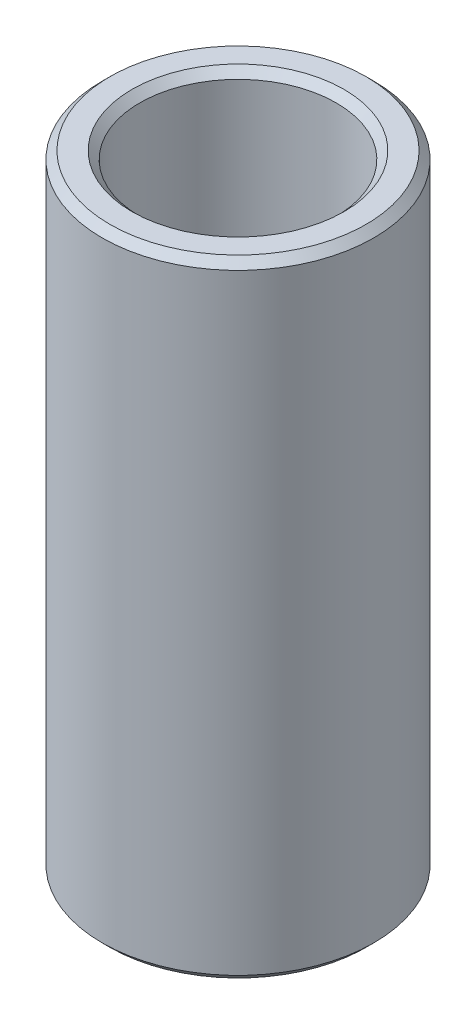
ISO-10303-21;
HEADER;
FILE_DESCRIPTION(('STEP AP214'),'2;1');
FILE_NAME('part.step','',(''),(''),'','','');
FILE_SCHEMA(('AUTOMOTIVE_DESIGN { 1 0 10303 214 1 1 1 1 }'));
ENDSEC;
DATA;
#1=APPLICATION_CONTEXT('core data for automotive mechanical design processes');
#2=APPLICATION_PROTOCOL_DEFINITION('international standard','automotive_design',2000,#1);
#3=PRODUCT_CONTEXT('',#1,'mechanical');
#4=PRODUCT('Part','Part','',(#3));
#5=PRODUCT_RELATED_PRODUCT_CATEGORY('part','',(#4));
#6=PRODUCT_DEFINITION_FORMATION('','',#4);
#7=PRODUCT_DEFINITION_CONTEXT('part definition',#1,'design');
#8=PRODUCT_DEFINITION('design','',#6,#7);
#9=PRODUCT_DEFINITION_SHAPE('','',#8);
#10=(LENGTH_UNIT() NAMED_UNIT(*) SI_UNIT(.MILLI.,.METRE.));
#11=(NAMED_UNIT(*) PLANE_ANGLE_UNIT() SI_UNIT($,.RADIAN.));
#12=(NAMED_UNIT(*) SI_UNIT($,.STERADIAN.) SOLID_ANGLE_UNIT());
#13=UNCERTAINTY_MEASURE_WITH_UNIT(LENGTH_MEASURE(1.E-05),#10,'distance_accuracy_value','');
#14=(GEOMETRIC_REPRESENTATION_CONTEXT(3) GLOBAL_UNCERTAINTY_ASSIGNED_CONTEXT((#13)) GLOBAL_UNIT_ASSIGNED_CONTEXT((#10,
#11,#12)) REPRESENTATION_CONTEXT('',''));
#15=CARTESIAN_POINT('',(0.,0.,0.));
#16=DIRECTION('',(0.,0.,1.));
#17=DIRECTION('',(1.,0.,0.));
#18=AXIS2_PLACEMENT_3D('',#15,#16,#17);
#19=CARTESIAN_POINT('',(0.,103.716904787319,0.));
#20=DIRECTION('',(0.,-1.,0.));
#21=DIRECTION('',(0.,0.,-1.));
#22=AXIS2_PLACEMENT_3D('',#19,#20,#21);
#23=CYLINDRICAL_SURFACE('',#22,22.5);
#24=CARTESIAN_POINT('',(0.,1.2887650130938,0.));
#25=DIRECTION('',(0.,1.,0.));
#26=DIRECTION('',(0.,0.,1.));
#27=AXIS2_PLACEMENT_3D('',#24,#25,#26);
#28=CIRCLE('',#27,22.5);
#29=CARTESIAN_POINT('',(0.,1.28876501309379,-22.5));
#30=VERTEX_POINT('',#29);
#31=EDGE_CURVE('E10',#30,#30,#28,.T.);
#32=CARTESIAN_POINT('',(0.,102.428139774225,0.));
#33=DIRECTION('',(0.,1.,0.));
#34=DIRECTION('',(0.,0.,1.));
#35=AXIS2_PLACEMENT_3D('',#32,#33,#34);
#36=CIRCLE('',#35,22.5);
#37=CARTESIAN_POINT('',(0.,102.428139774225,-22.5));
#38=VERTEX_POINT('',#37);
#39=EDGE_CURVE('E50',#38,#38,#36,.F.);
#40=CARTESIAN_POINT('',(0.,1.28876501309379,-22.5));
#41=CARTESIAN_POINT('',(0.,2.34230016685558,-22.5));
#42=CARTESIAN_POINT('',(0.,3.39583532061737,-22.5));
#43=CARTESIAN_POINT('',(0.,5.50290562814094,-22.5));
#44=CARTESIAN_POINT('',(0.,6.55644078190273,-22.5));
#45=CARTESIAN_POINT('',(0.,8.6635110894263,-22.5));
#46=CARTESIAN_POINT('',(0.,9.71704624318809,-22.5));
#47=CARTESIAN_POINT('',(0.,11.8241165507117,-22.5));
#48=CARTESIAN_POINT('',(0.,12.8776517044734,-22.5));
#49=CARTESIAN_POINT('',(0.,14.984722011997,-22.5));
#50=CARTESIAN_POINT('',(0.,16.0382571657588,-22.5));
#51=CARTESIAN_POINT('',(0.,18.1453274732824,-22.5));
#52=CARTESIAN_POINT('',(0.,19.1988626270442,-22.5));
#53=CARTESIAN_POINT('',(0.,21.3059329345678,-22.5));
#54=CARTESIAN_POINT('',(0.,22.3594680883295,-22.5));
#55=CARTESIAN_POINT('',(0.,24.4665383958531,-22.5));
#56=CARTESIAN_POINT('',(0.,25.5200735496149,-22.5));
#57=CARTESIAN_POINT('',(0.,27.6271438571385,-22.5));
#58=CARTESIAN_POINT('',(0.,28.6806790109003,-22.5));
#59=CARTESIAN_POINT('',(0.,30.7877493184238,-22.5));
#60=CARTESIAN_POINT('',(0.,31.8412844721856,-22.5));
#61=CARTESIAN_POINT('',(0.,33.9483547797092,-22.5));
#62=CARTESIAN_POINT('',(0.,35.001889933471,-22.5));
#63=CARTESIAN_POINT('',(0.,37.1089602409946,-22.5));
#64=CARTESIAN_POINT('',(0.,38.1624953947563,-22.5));
#65=CARTESIAN_POINT('',(0.,40.2695657022799,-22.5));
#66=CARTESIAN_POINT('',(0.,41.3231008560417,-22.5));
#67=CARTESIAN_POINT('',(0.,43.4301711635653,-22.5));
#68=CARTESIAN_POINT('',(0.,44.4837063173271,-22.5));
#69=CARTESIAN_POINT('',(0.,46.5907766248506,-22.5));
#70=CARTESIAN_POINT('',(0.,47.6443117786124,-22.5));
#71=CARTESIAN_POINT('',(0.,49.751382086136,-22.5));
#72=CARTESIAN_POINT('',(0.,50.8049172398978,-22.5));
#73=CARTESIAN_POINT('',(0.,52.9119875474214,-22.5));
#74=CARTESIAN_POINT('',(0.,53.9655227011831,-22.5));
#75=CARTESIAN_POINT('',(0.,56.0725930087067,-22.5));
#76=CARTESIAN_POINT('',(0.,57.1261281624685,-22.5));
#77=CARTESIAN_POINT('',(0.,59.2331984699921,-22.5));
#78=CARTESIAN_POINT('',(0.,60.2867336237539,-22.5));
#79=CARTESIAN_POINT('',(0.,62.3938039312774,-22.5));
#80=CARTESIAN_POINT('',(0.,63.4473390850392,-22.5));
#81=CARTESIAN_POINT('',(0.,65.5544093925628,-22.5));
#82=CARTESIAN_POINT('',(0.,66.6079445463246,-22.5));
#83=CARTESIAN_POINT('',(0.,68.7150148538482,-22.5));
#84=CARTESIAN_POINT('',(0.,69.7685500076099,-22.5));
#85=CARTESIAN_POINT('',(0.,71.8756203151335,-22.5));
#86=CARTESIAN_POINT('',(0.,72.9291554688953,-22.5));
#87=CARTESIAN_POINT('',(0.,75.0362257764189,-22.5));
#88=CARTESIAN_POINT('',(0.,76.0897609301807,-22.5));
#89=CARTESIAN_POINT('',(0.,78.1968312377043,-22.5));
#90=CARTESIAN_POINT('',(0.,79.250366391466,-22.5));
#91=CARTESIAN_POINT('',(0.,81.3574366989896,-22.5));
#92=CARTESIAN_POINT('',(0.,82.4109718527514,-22.5));
#93=CARTESIAN_POINT('',(0.,84.518042160275,-22.5));
#94=CARTESIAN_POINT('',(0.,85.5715773140367,-22.5));
#95=CARTESIAN_POINT('',(0.,87.6786476215603,-22.5));
#96=CARTESIAN_POINT('',(0.,88.7321827753221,-22.5));
#97=CARTESIAN_POINT('',(0.,90.8392530828457,-22.5));
#98=CARTESIAN_POINT('',(0.,91.8927882366075,-22.5));
#99=CARTESIAN_POINT('',(0.,93.9998585441311,-22.5));
#100=CARTESIAN_POINT('',(0.,95.0533936978928,-22.5));
#101=CARTESIAN_POINT('',(0.,97.1604640054164,-22.5));
#102=CARTESIAN_POINT('',(0.,98.2139991591782,-22.5));
#103=CARTESIAN_POINT('',(0.,100.321069466702,-22.5));
#104=CARTESIAN_POINT('',(0.,101.374604620464,-22.5));
#105=CARTESIAN_POINT('',(0.,102.428139774225,-22.5));
#106=B_SPLINE_CURVE_WITH_KNOTS('',3,(#40,#41,#42,#43,#44,#45,#46,#47,#48,#49,#50,#51,#52,#53,
#54,#55,#56,#57,#58,#59,#60,#61,#62,#63,#64,#65,#66,#67,#68,#69,#70,#71,#72,#73,#74,#75,#76,#77,
#78,#79,#80,#81,#82,#83,#84,#85,#86,#87,#88,#89,#90,#91,#92,#93,#94,#95,#96,#97,#98,#99,#100,
#101,#102,#103,#104,#105),.UNSPECIFIED.,.F.,.F.,(4,2,2,2,2,2,2,2,2,2,2,2,2,2,2,2,2,2,2,2,2,2,2,
2,2,2,2,2,2,2,2,2,4),(0.,3.16060546128537,6.32121092257072,9.48181638385609,12.6424218451414,
15.8030273064268,18.9636327677122,22.1242382289975,25.2848436902829,28.4454491515683,
31.6060546128536,34.766660074139,37.9272655354243,41.0878709967097,44.2484764579951,
47.4090819192804,50.5696873805658,53.7302928418511,56.8908983031365,60.0515037644219,
63.2121092257072,66.3727146869926,69.5333201482779,72.6939256095633,75.8545310708487,
79.015136532134,82.1757419934194,85.3363474547048,88.4969529159901,91.6575583772755,
94.8181638385608,97.9787692998462,101.139374761132),.UNSPECIFIED.);
#107=EDGE_CURVE('BSEAM39',#30,#38,#106,.T.);
#108=ORIENTED_EDGE('',*,*,#31,.T.);
#109=ORIENTED_EDGE('',*,*,#39,.T.);
#110=ORIENTED_EDGE('',*,*,#107,.T.);
#111=ORIENTED_EDGE('',*,*,#107,.F.);
#112=EDGE_LOOP('',(#108,#110,#109,#111));
#113=FACE_BOUND('',#112,.T.);
#114=ADVANCED_FACE('F39',(#113),#23,.T.);
#115=CARTESIAN_POINT('',(0.,103.716904787319,0.));
#116=DIRECTION('',(0.,1.,0.));
#117=DIRECTION('',(0.,0.,1.));
#118=AXIS2_PLACEMENT_3D('',#115,#116,#117);
#119=PLANE('',#118);
#120=CARTESIAN_POINT('',(0.,103.716904787319,0.));
#121=DIRECTION('',(0.,1.,0.));
#122=DIRECTION('',(0.,0.,1.));
#123=AXIS2_PLACEMENT_3D('',#120,#121,#122);
#124=CIRCLE('',#123,17.5568091373868);
#125=CARTESIAN_POINT('',(0.,103.716904787319,17.5568091373868));
#126=VERTEX_POINT('',#125);
#127=EDGE_CURVE('E58',#126,#126,#124,.F.);
#128=ORIENTED_EDGE('',*,*,#127,.T.);
#129=EDGE_LOOP('',(#128));
#130=FACE_BOUND('',#129,.T.);
#131=CARTESIAN_POINT('',(0.,103.716904787319,0.));
#132=DIRECTION('',(0.,1.,0.));
#133=DIRECTION('',(0.,0.,1.));
#134=AXIS2_PLACEMENT_3D('',#131,#132,#133);
#135=CIRCLE('',#134,21.2112349869064);
#136=CARTESIAN_POINT('',(0.,103.716904787319,21.2112349869064));
#137=VERTEX_POINT('',#136);
#138=EDGE_CURVE('E61',#137,#137,#135,.T.);
#139=ORIENTED_EDGE('',*,*,#138,.T.);
#140=EDGE_LOOP('',(#139));
#141=FACE_BOUND('',#140,.T.);
#142=ADVANCED_FACE('F88',(#130,#141),#119,.T.);
#143=CARTESIAN_POINT('',(0.,0.,0.));
#144=DIRECTION('',(0.,1.,0.));
#145=DIRECTION('',(0.,0.,1.));
#146=AXIS2_PLACEMENT_3D('',#143,#144,#145);
#147=PLANE('',#146);
#148=CARTESIAN_POINT('',(0.,0.,0.));
#149=DIRECTION('',(0.,1.,0.));
#150=DIRECTION('',(0.,0.,1.));
#151=AXIS2_PLACEMENT_3D('',#148,#149,#150);
#152=CIRCLE('',#151,17.5568091373867);
#153=CARTESIAN_POINT('',(0.,0.,17.5568091373867));
#154=VERTEX_POINT('',#153);
#155=EDGE_CURVE('E51',#154,#154,#152,.T.);
#156=ORIENTED_EDGE('',*,*,#155,.T.);
#157=EDGE_LOOP('',(#156));
#158=FACE_BOUND('',#157,.T.);
#159=CARTESIAN_POINT('',(0.,0.,0.));
#160=DIRECTION('',(0.,1.,0.));
#161=DIRECTION('',(0.,0.,1.));
#162=AXIS2_PLACEMENT_3D('',#159,#160,#161);
#163=CIRCLE('',#162,21.2112349869062);
#164=CARTESIAN_POINT('',(0.,0.,21.2112349869062));
#165=VERTEX_POINT('',#164);
#166=EDGE_CURVE('E54',#165,#165,#163,.F.);
#167=ORIENTED_EDGE('',*,*,#166,.T.);
#168=EDGE_LOOP('',(#167));
#169=FACE_BOUND('',#168,.T.);
#170=ADVANCED_FACE('F83',(#158,#169),#147,.F.);
#171=CARTESIAN_POINT('',(0.,103.716904787319,0.));
#172=DIRECTION('',(0.,-1.,0.));
#173=DIRECTION('',(0.,0.,-1.));
#174=AXIS2_PLACEMENT_3D('',#171,#172,#173);
#175=CYLINDRICAL_SURFACE('',#174,16.2680441242929);
#176=CARTESIAN_POINT('',(0.,102.428139774225,0.));
#177=DIRECTION('',(0.,1.,0.));
#178=DIRECTION('',(0.,0.,1.));
#179=AXIS2_PLACEMENT_3D('',#176,#177,#178);
#180=CIRCLE('',#179,16.2680441242929);
#181=CARTESIAN_POINT('',(0.,102.428139774225,-16.2680441242929));
#182=VERTEX_POINT('',#181);
#183=EDGE_CURVE('E67',#182,#182,#180,.T.);
#184=CARTESIAN_POINT('',(0.,1.28876501309376,0.));
#185=DIRECTION('',(0.,1.,0.));
#186=DIRECTION('',(0.,0.,1.));
#187=AXIS2_PLACEMENT_3D('',#184,#185,#186);
#188=CIRCLE('',#187,16.2680441242929);
#189=CARTESIAN_POINT('',(0.,1.28876501309376,-16.2680441242929));
#190=VERTEX_POINT('',#189);
#191=EDGE_CURVE('E69',#190,#190,#188,.F.);
#192=CARTESIAN_POINT('',(0.,102.428139774225,-16.2680441242929));
#193=CARTESIAN_POINT('',(0.,101.374604620463,-16.2680441242929));
#194=CARTESIAN_POINT('',(0.,100.321069466702,-16.2680441242929));
#195=CARTESIAN_POINT('',(0.,98.2139991591781,-16.2680441242929));
#196=CARTESIAN_POINT('',(0.,97.1604640054163,-16.2680441242929));
#197=CARTESIAN_POINT('',(0.,95.0533936978927,-16.2680441242929));
#198=CARTESIAN_POINT('',(0.,93.9998585441309,-16.2680441242929));
#199=CARTESIAN_POINT('',(0.,91.8927882366073,-16.2680441242929));
#200=CARTESIAN_POINT('',(0.,90.8392530828456,-16.2680441242929));
#201=CARTESIAN_POINT('',(0.,88.732182775322,-16.2680441242929));
#202=CARTESIAN_POINT('',(0.,87.6786476215602,-16.2680441242929));
#203=CARTESIAN_POINT('',(0.,85.5715773140366,-16.2680441242929));
#204=CARTESIAN_POINT('',(0.,84.5180421602748,-16.2680441242929));
#205=CARTESIAN_POINT('',(0.,82.4109718527513,-16.2680441242929));
#206=CARTESIAN_POINT('',(0.,81.3574366989895,-16.2680441242929));
#207=CARTESIAN_POINT('',(0.,79.2503663914659,-16.2680441242929));
#208=CARTESIAN_POINT('',(0.,78.1968312377041,-16.2680441242929));
#209=CARTESIAN_POINT('',(0.,76.0897609301806,-16.2680441242929));
#210=CARTESIAN_POINT('',(0.,75.0362257764188,-16.2680441242929));
#211=CARTESIAN_POINT('',(0.,72.9291554688952,-16.2680441242929));
#212=CARTESIAN_POINT('',(0.,71.8756203151334,-16.2680441242929));
#213=CARTESIAN_POINT('',(0.,69.7685500076098,-16.2680441242929));
#214=CARTESIAN_POINT('',(0.,68.7150148538481,-16.2680441242929));
#215=CARTESIAN_POINT('',(0.,66.6079445463245,-16.2680441242929));
#216=CARTESIAN_POINT('',(0.,65.5544093925627,-16.2680441242929));
#217=CARTESIAN_POINT('',(0.,63.4473390850391,-16.2680441242929));
#218=CARTESIAN_POINT('',(0.,62.3938039312773,-16.2680441242929));
#219=CARTESIAN_POINT('',(0.,60.2867336237538,-16.2680441242929));
#220=CARTESIAN_POINT('',(0.,59.233198469992,-16.2680441242929));
#221=CARTESIAN_POINT('',(0.,57.1261281624684,-16.2680441242929));
#222=CARTESIAN_POINT('',(0.,56.0725930087066,-16.2680441242929));
#223=CARTESIAN_POINT('',(0.,53.9655227011831,-16.2680441242929));
#224=CARTESIAN_POINT('',(0.,52.9119875474213,-16.2680441242929));
#225=CARTESIAN_POINT('',(0.,50.8049172398977,-16.2680441242929));
#226=CARTESIAN_POINT('',(0.,49.7513820861359,-16.2680441242929));
#227=CARTESIAN_POINT('',(0.,47.6443117786123,-16.2680441242929));
#228=CARTESIAN_POINT('',(0.,46.5907766248506,-16.2680441242929));
#229=CARTESIAN_POINT('',(0.,44.483706317327,-16.2680441242929));
#230=CARTESIAN_POINT('',(0.,43.4301711635652,-16.2680441242929));
#231=CARTESIAN_POINT('',(0.,41.3231008560416,-16.2680441242929));
#232=CARTESIAN_POINT('',(0.,40.2695657022798,-16.2680441242929));
#233=CARTESIAN_POINT('',(0.,38.1624953947563,-16.2680441242929));
#234=CARTESIAN_POINT('',(0.,37.1089602409945,-16.2680441242929));
#235=CARTESIAN_POINT('',(0.,35.0018899334709,-16.2680441242929));
#236=CARTESIAN_POINT('',(0.,33.9483547797091,-16.2680441242929));
#237=CARTESIAN_POINT('',(0.,31.8412844721856,-16.2680441242929));
#238=CARTESIAN_POINT('',(0.,30.7877493184238,-16.2680441242929));
#239=CARTESIAN_POINT('',(0.,28.6806790109002,-16.2680441242929));
#240=CARTESIAN_POINT('',(0.,27.6271438571384,-16.2680441242929));
#241=CARTESIAN_POINT('',(0.,25.5200735496148,-16.2680441242929));
#242=CARTESIAN_POINT('',(0.,24.466538395853,-16.2680441242929));
#243=CARTESIAN_POINT('',(0.,22.3594680883295,-16.2680441242929));
#244=CARTESIAN_POINT('',(0.,21.3059329345677,-16.2680441242929));
#245=CARTESIAN_POINT('',(0.,19.1988626270441,-16.2680441242929));
#246=CARTESIAN_POINT('',(0.,18.1453274732823,-16.2680441242929));
#247=CARTESIAN_POINT('',(0.,16.0382571657588,-16.2680441242929));
#248=CARTESIAN_POINT('',(0.,14.984722011997,-16.2680441242929));
#249=CARTESIAN_POINT('',(0.,12.8776517044734,-16.2680441242929));
#250=CARTESIAN_POINT('',(0.,11.8241165507116,-16.2680441242929));
#251=CARTESIAN_POINT('',(0.,9.71704624318805,-16.2680441242929));
#252=CARTESIAN_POINT('',(0.,8.66351108942627,-16.2680441242929));
#253=CARTESIAN_POINT('',(0.,6.55644078190269,-16.2680441242929));
#254=CARTESIAN_POINT('',(0.,5.5029056281409,-16.2680441242929));
#255=CARTESIAN_POINT('',(0.,3.39583532061733,-16.2680441242929));
#256=CARTESIAN_POINT('',(0.,2.34230016685554,-16.2680441242929));
#257=CARTESIAN_POINT('',(0.,1.28876501309376,-16.2680441242929));
#258=B_SPLINE_CURVE_WITH_KNOTS('',3,(#192,#193,#194,#195,#196,#197,#198,#199,#200,#201,#202,
#203,#204,#205,#206,#207,#208,#209,#210,#211,#212,#213,#214,#215,#216,#217,#218,#219,#220,#221,
#222,#223,#224,#225,#226,#227,#228,#229,#230,#231,#232,#233,#234,#235,#236,#237,#238,#239,#240,
#241,#242,#243,#244,#245,#246,#247,#248,#249,#250,#251,#252,#253,#254,#255,#256,#257),
.UNSPECIFIED.,.F.,.F.,(4,2,2,2,2,2,2,2,2,2,2,2,2,2,2,2,2,2,2,2,2,2,2,2,2,2,2,2,2,2,2,2,4),(0.,
3.16060546128535,6.32121092257071,9.48181638385606,12.6424218451414,15.8030273064268,
18.9636327677121,22.1242382289975,25.2848436902828,28.4454491515682,31.6060546128536,
34.7666600741389,37.9272655354243,41.0878709967096,44.248476457995,47.4090819192804,
50.5696873805657,53.7302928418511,56.8908983031364,60.0515037644218,63.2121092257072,
66.3727146869925,69.5333201482779,72.6939256095632,75.8545310708486,79.0151365321339,
82.1757419934193,85.3363474547047,88.49695291599,91.6575583772754,94.8181638385607,
97.9787692998461,101.139374761131),.UNSPECIFIED.);
#259=EDGE_CURVE('BSEAM71',#182,#190,#258,.T.);
#260=ORIENTED_EDGE('',*,*,#183,.T.);
#261=ORIENTED_EDGE('',*,*,#191,.T.);
#262=ORIENTED_EDGE('',*,*,#259,.T.);
#263=ORIENTED_EDGE('',*,*,#259,.F.);
#264=EDGE_LOOP('',(#260,#262,#261,#263));
#265=FACE_BOUND('',#264,.T.);
#266=ADVANCED_FACE('F71',(#265),#175,.F.);
#267=CARTESIAN_POINT('',(0.,102.428139774225,0.));
#268=DIRECTION('',(0.,1.,0.));
#269=DIRECTION('',(0.,0.,1.));
#270=AXIS2_PLACEMENT_3D('',#267,#268,#269);
#271=CONICAL_SURFACE('',#270,16.2680441242929,0.785398163397446);
#272=ORIENTED_EDGE('',*,*,#127,.F.);
#273=EDGE_LOOP('',(#272));
#274=FACE_BOUND('',#273,.T.);
#275=ORIENTED_EDGE('',*,*,#183,.F.);
#276=EDGE_LOOP('',(#275));
#277=FACE_BOUND('',#276,.T.);
#278=ADVANCED_FACE('F77',(#274,#277),#271,.F.);
#279=CARTESIAN_POINT('',(0.,0.,0.));
#280=DIRECTION('',(0.,-1.,0.));
#281=DIRECTION('',(0.,0.,-1.));
#282=AXIS2_PLACEMENT_3D('',#279,#280,#281);
#283=CONICAL_SURFACE('',#282,17.5568091373867,0.785398163397442);
#284=ORIENTED_EDGE('',*,*,#191,.F.);
#285=EDGE_LOOP('',(#284));
#286=FACE_BOUND('',#285,.T.);
#287=ORIENTED_EDGE('',*,*,#155,.F.);
#288=EDGE_LOOP('',(#287));
#289=FACE_BOUND('',#288,.T.);
#290=ADVANCED_FACE('F73',(#286,#289),#283,.F.);
#291=CARTESIAN_POINT('',(0.,1.2887650130938,0.));
#292=DIRECTION('',(0.,1.,0.));
#293=DIRECTION('',(0.,0.,1.));
#294=AXIS2_PLACEMENT_3D('',#291,#292,#293);
#295=CONICAL_SURFACE('',#294,22.5,0.785398163397454);
#296=ORIENTED_EDGE('',*,*,#166,.F.);
#297=EDGE_LOOP('',(#296));
#298=FACE_BOUND('',#297,.T.);
#299=ORIENTED_EDGE('',*,*,#31,.F.);
#300=EDGE_LOOP('',(#299));
#301=FACE_BOUND('',#300,.T.);
#302=ADVANCED_FACE('F76',(#298,#301),#295,.T.);
#303=CARTESIAN_POINT('',(0.,103.716904787319,0.));
#304=DIRECTION('',(0.,-1.,0.));
#305=DIRECTION('',(0.,0.,-1.));
#306=AXIS2_PLACEMENT_3D('',#303,#304,#305);
#307=CONICAL_SURFACE('',#306,21.2112349869064,0.785398163397438);
#308=ORIENTED_EDGE('',*,*,#39,.F.);
#309=EDGE_LOOP('',(#308));
#310=FACE_BOUND('',#309,.T.);
#311=ORIENTED_EDGE('',*,*,#138,.F.);
#312=EDGE_LOOP('',(#311));
#313=FACE_BOUND('',#312,.T.);
#314=ADVANCED_FACE('F45',(#310,#313),#307,.T.);
#315=CLOSED_SHELL('',(#114,#142,#170,#266,#278,#290,#302,#314));
#316=MANIFOLD_SOLID_BREP('B2',#315);
#317=ADVANCED_BREP_SHAPE_REPRESENTATION('',(#18,#316),#14);
#318=SHAPE_DEFINITION_REPRESENTATION(#9,#317);
ENDSEC;
END-ISO-10303-21;
